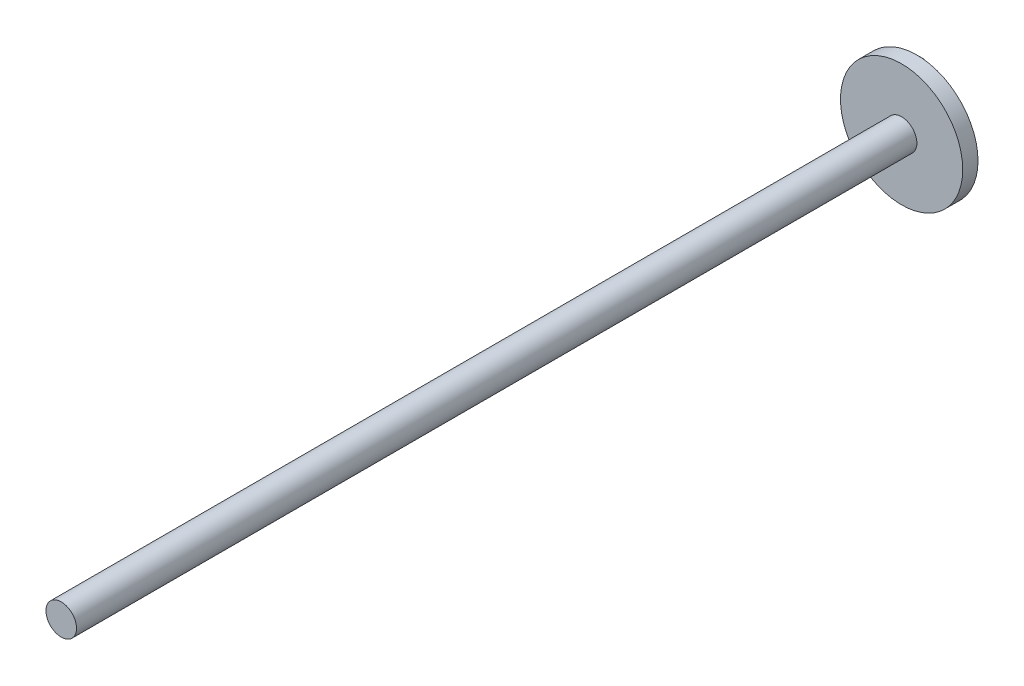
ISO-10303-21;
HEADER;
FILE_DESCRIPTION(('STEP AP214'),'2;1');
FILE_NAME('part.step','',(''),(''),'','','');
FILE_SCHEMA(('AUTOMOTIVE_DESIGN { 1 0 10303 214 1 1 1 1 }'));
ENDSEC;
DATA;
#1=APPLICATION_CONTEXT('core data for automotive mechanical design processes');
#2=APPLICATION_PROTOCOL_DEFINITION('international standard','automotive_design',2000,#1);
#3=PRODUCT_CONTEXT('',#1,'mechanical');
#4=PRODUCT('Part','Part','',(#3));
#5=PRODUCT_RELATED_PRODUCT_CATEGORY('part','',(#4));
#6=PRODUCT_DEFINITION_FORMATION('','',#4);
#7=PRODUCT_DEFINITION_CONTEXT('part definition',#1,'design');
#8=PRODUCT_DEFINITION('design','',#6,#7);
#9=PRODUCT_DEFINITION_SHAPE('','',#8);
#10=(LENGTH_UNIT() NAMED_UNIT(*) SI_UNIT(.MILLI.,.METRE.));
#11=(NAMED_UNIT(*) PLANE_ANGLE_UNIT() SI_UNIT($,.RADIAN.));
#12=(NAMED_UNIT(*) SI_UNIT($,.STERADIAN.) SOLID_ANGLE_UNIT());
#13=UNCERTAINTY_MEASURE_WITH_UNIT(LENGTH_MEASURE(1.E-05),#10,'distance_accuracy_value','');
#14=(GEOMETRIC_REPRESENTATION_CONTEXT(3) GLOBAL_UNCERTAINTY_ASSIGNED_CONTEXT((#13)) GLOBAL_UNIT_ASSIGNED_CONTEXT((#10,
#11,#12)) REPRESENTATION_CONTEXT('',''));
#15=CARTESIAN_POINT('',(0.,0.,0.));
#16=DIRECTION('',(0.,0.,1.));
#17=DIRECTION('',(1.,0.,0.));
#18=AXIS2_PLACEMENT_3D('',#15,#16,#17);
#19=CARTESIAN_POINT('',(0.,0.,10.));
#20=DIRECTION('',(0.,0.,-1.));
#21=DIRECTION('',(-1.,0.,0.));
#22=AXIS2_PLACEMENT_3D('',#19,#20,#21);
#23=CYLINDRICAL_SURFACE('',#22,40.);
#24=CARTESIAN_POINT('',(0.,0.,10.));
#25=DIRECTION('',(0.,0.,1.));
#26=DIRECTION('',(1.,0.,0.));
#27=AXIS2_PLACEMENT_3D('',#24,#25,#26);
#28=CIRCLE('',#27,40.);
#29=CARTESIAN_POINT('',(40.,0.,10.));
#30=VERTEX_POINT('',#29);
#31=EDGE_CURVE('E57',#30,#30,#28,.T.);
#32=ORIENTED_EDGE('',*,*,#31,.F.);
#33=EDGE_LOOP('',(#32));
#34=FACE_BOUND('',#33,.T.);
#35=CARTESIAN_POINT('',(0.,0.,0.));
#36=DIRECTION('',(0.,0.,1.));
#37=DIRECTION('',(1.,0.,0.));
#38=AXIS2_PLACEMENT_3D('',#35,#36,#37);
#39=CIRCLE('',#38,40.);
#40=CARTESIAN_POINT('',(40.,0.,0.));
#41=VERTEX_POINT('',#40);
#42=EDGE_CURVE('E62',#41,#41,#39,.T.);
#43=ORIENTED_EDGE('',*,*,#42,.T.);
#44=EDGE_LOOP('',(#43));
#45=FACE_BOUND('',#44,.T.);
#46=ADVANCED_FACE('F47',(#34,#45),#23,.T.);
#47=CARTESIAN_POINT('',(0.,0.,10.));
#48=DIRECTION('',(0.,0.,1.));
#49=DIRECTION('',(1.,0.,0.));
#50=AXIS2_PLACEMENT_3D('',#47,#48,#49);
#51=PLANE('',#50);
#52=CARTESIAN_POINT('',(0.,0.,10.));
#53=DIRECTION('',(0.,0.,1.));
#54=DIRECTION('',(1.,0.,0.));
#55=AXIS2_PLACEMENT_3D('',#52,#53,#54);
#56=CIRCLE('',#55,10.);
#57=CARTESIAN_POINT('',(10.,0.,10.));
#58=VERTEX_POINT('',#57);
#59=EDGE_CURVE('E53',#58,#58,#56,.T.);
#60=ORIENTED_EDGE('',*,*,#59,.F.);
#61=EDGE_LOOP('',(#60));
#62=FACE_BOUND('',#61,.T.);
#63=ORIENTED_EDGE('',*,*,#31,.T.);
#64=EDGE_LOOP('',(#63));
#65=FACE_BOUND('',#64,.T.);
#66=ADVANCED_FACE('F91',(#62,#65),#51,.T.);
#67=CARTESIAN_POINT('',(0.,0.,0.));
#68=DIRECTION('',(0.,0.,1.));
#69=DIRECTION('',(1.,0.,0.));
#70=AXIS2_PLACEMENT_3D('',#67,#68,#69);
#71=PLANE('',#70);
#72=CARTESIAN_POINT('',(-26.9985619159408,0.,0.));
#73=DIRECTION('',(0.,0.,1.));
#74=DIRECTION('',(1.,0.,0.));
#75=AXIS2_PLACEMENT_3D('',#72,#73,#74);
#76=CIRCLE('',#75,10.);
#77=CARTESIAN_POINT('',(-16.9985619159408,0.,0.));
#78=VERTEX_POINT('',#77);
#79=EDGE_CURVE('E10',#78,#78,#76,.F.);
#80=ORIENTED_EDGE('',*,*,#79,.F.);
#81=EDGE_LOOP('',(#80));
#82=FACE_BOUND('',#81,.T.);
#83=ORIENTED_EDGE('',*,*,#42,.F.);
#84=EDGE_LOOP('',(#83));
#85=FACE_BOUND('',#84,.T.);
#86=ADVANCED_FACE('F96',(#82,#85),#71,.F.);
#87=CARTESIAN_POINT('',(0.,0.,560.));
#88=DIRECTION('',(0.,0.,-1.));
#89=DIRECTION('',(-1.,0.,0.));
#90=AXIS2_PLACEMENT_3D('',#87,#88,#89);
#91=CYLINDRICAL_SURFACE('',#90,10.);
#92=CARTESIAN_POINT('',(0.,0.,560.));
#93=DIRECTION('',(0.,0.,1.));
#94=DIRECTION('',(1.,0.,0.));
#95=AXIS2_PLACEMENT_3D('',#92,#93,#94);
#96=CIRCLE('',#95,10.);
#97=CARTESIAN_POINT('',(10.,0.,560.));
#98=VERTEX_POINT('',#97);
#99=EDGE_CURVE('E65',#98,#98,#96,.T.);
#100=ORIENTED_EDGE('',*,*,#99,.F.);
#101=EDGE_LOOP('',(#100));
#102=FACE_BOUND('',#101,.T.);
#103=ORIENTED_EDGE('',*,*,#59,.T.);
#104=EDGE_LOOP('',(#103));
#105=FACE_BOUND('',#104,.T.);
#106=ADVANCED_FACE('F88',(#102,#105),#91,.T.);
#107=CARTESIAN_POINT('',(0.,0.,560.));
#108=DIRECTION('',(0.,0.,1.));
#109=DIRECTION('',(1.,0.,0.));
#110=AXIS2_PLACEMENT_3D('',#107,#108,#109);
#111=PLANE('',#110);
#112=ORIENTED_EDGE('',*,*,#99,.T.);
#113=EDGE_LOOP('',(#112));
#114=FACE_BOUND('',#113,.T.);
#115=ADVANCED_FACE('F81',(#114),#111,.T.);
#116=CARTESIAN_POINT('',(-26.9985619159408,0.,-30.));
#117=DIRECTION('',(0.,0.,1.));
#118=DIRECTION('',(1.,0.,0.));
#119=AXIS2_PLACEMENT_3D('',#116,#117,#118);
#120=CYLINDRICAL_SURFACE('',#119,10.);
#121=CARTESIAN_POINT('',(-26.9985619159408,0.,-30.));
#122=DIRECTION('',(0.,0.,-1.));
#123=DIRECTION('',(-1.,0.,0.));
#124=AXIS2_PLACEMENT_3D('',#121,#122,#123);
#125=CIRCLE('',#124,10.);
#126=CARTESIAN_POINT('',(-36.9985619159408,0.,-30.));
#127=VERTEX_POINT('',#126);
#128=EDGE_CURVE('E71',#127,#127,#125,.T.);
#129=ORIENTED_EDGE('',*,*,#128,.F.);
#130=EDGE_LOOP('',(#129));
#131=FACE_BOUND('',#130,.T.);
#132=ORIENTED_EDGE('',*,*,#79,.T.);
#133=EDGE_LOOP('',(#132));
#134=FACE_BOUND('',#133,.T.);
#135=ADVANCED_FACE('F79',(#131,#134),#120,.T.);
#136=CARTESIAN_POINT('',(-26.9985619159408,0.,-30.));
#137=DIRECTION('',(0.,0.,-1.));
#138=DIRECTION('',(-1.,0.,0.));
#139=AXIS2_PLACEMENT_3D('',#136,#137,#138);
#140=PLANE('',#139);
#141=ORIENTED_EDGE('',*,*,#128,.T.);
#142=EDGE_LOOP('',(#141));
#143=FACE_BOUND('',#142,.T.);
#144=ADVANCED_FACE('F77',(#143),#140,.T.);
#145=CLOSED_SHELL('',(#46,#66,#86,#106,#115,#135,#144));
#146=MANIFOLD_SOLID_BREP('B2',#145);
#147=ADVANCED_BREP_SHAPE_REPRESENTATION('',(#18,#146),#14);
#148=SHAPE_DEFINITION_REPRESENTATION(#9,#147);
ENDSEC;
END-ISO-10303-21;
